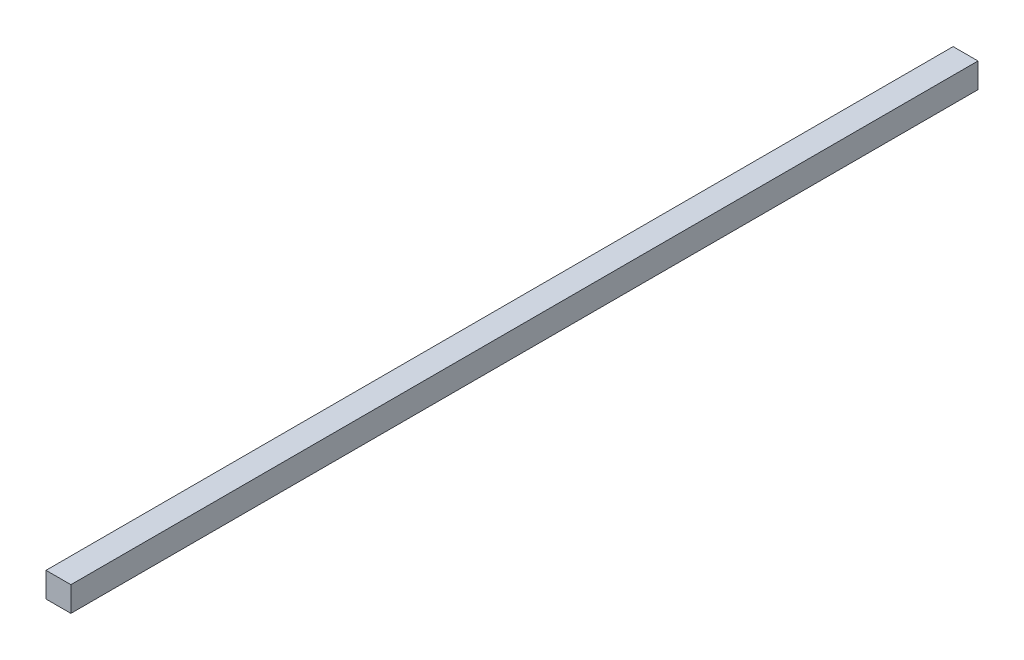
ISO-10303-21;
HEADER;
FILE_DESCRIPTION(('STEP AP214'),'2;1');
FILE_NAME('part.step','',(''),(''),'','','');
FILE_SCHEMA(('AUTOMOTIVE_DESIGN { 1 0 10303 214 1 1 1 1 }'));
ENDSEC;
DATA;
#1=APPLICATION_CONTEXT('core data for automotive mechanical design processes');
#2=APPLICATION_PROTOCOL_DEFINITION('international standard','automotive_design',2000,#1);
#3=PRODUCT_CONTEXT('',#1,'mechanical');
#4=PRODUCT('Part','Part','',(#3));
#5=PRODUCT_RELATED_PRODUCT_CATEGORY('part','',(#4));
#6=PRODUCT_DEFINITION_FORMATION('','',#4);
#7=PRODUCT_DEFINITION_CONTEXT('part definition',#1,'design');
#8=PRODUCT_DEFINITION('design','',#6,#7);
#9=PRODUCT_DEFINITION_SHAPE('','',#8);
#10=(LENGTH_UNIT() NAMED_UNIT(*) SI_UNIT(.MILLI.,.METRE.));
#11=(NAMED_UNIT(*) PLANE_ANGLE_UNIT() SI_UNIT($,.RADIAN.));
#12=(NAMED_UNIT(*) SI_UNIT($,.STERADIAN.) SOLID_ANGLE_UNIT());
#13=UNCERTAINTY_MEASURE_WITH_UNIT(LENGTH_MEASURE(1.E-05),#10,'distance_accuracy_value','');
#14=(GEOMETRIC_REPRESENTATION_CONTEXT(3) GLOBAL_UNCERTAINTY_ASSIGNED_CONTEXT((#13)) GLOBAL_UNIT_ASSIGNED_CONTEXT((#10,
#11,#12)) REPRESENTATION_CONTEXT('',''));
#15=CARTESIAN_POINT('',(0.,0.,0.));
#16=DIRECTION('',(0.,0.,1.));
#17=DIRECTION('',(1.,0.,0.));
#18=AXIS2_PLACEMENT_3D('',#15,#16,#17);
#19=CARTESIAN_POINT('',(10.,-10.,364.5));
#20=DIRECTION('',(-1.,0.,0.));
#21=DIRECTION('',(0.,0.,1.));
#22=AXIS2_PLACEMENT_3D('',#19,#20,#21);
#23=PLANE('',#22);
#24=DIRECTION('',(0.,1.,0.));
#25=VECTOR('',#24,1.);
#26=CARTESIAN_POINT('',(10.,-10.,-364.5));
#27=LINE('',#26,#25);
#28=CARTESIAN_POINT('',(10.,-10.,-364.5));
#29=VERTEX_POINT('',#28);
#30=CARTESIAN_POINT('',(10.,10.,-364.5));
#31=VERTEX_POINT('',#30);
#32=EDGE_CURVE('E98',#29,#31,#27,.T.);
#33=ORIENTED_EDGE('',*,*,#32,.T.);
#34=DIRECTION('',(0.,0.,-1.));
#35=VECTOR('',#34,1.);
#36=CARTESIAN_POINT('',(10.,10.,364.5));
#37=LINE('',#36,#35);
#38=CARTESIAN_POINT('',(10.,10.,364.5));
#39=VERTEX_POINT('',#38);
#40=EDGE_CURVE('E11',#39,#31,#37,.T.);
#41=ORIENTED_EDGE('',*,*,#40,.F.);
#42=DIRECTION('',(0.,1.,0.));
#43=VECTOR('',#42,1.);
#44=CARTESIAN_POINT('',(10.,-10.,364.5));
#45=LINE('',#44,#43);
#46=CARTESIAN_POINT('',(10.,-10.,364.5));
#47=VERTEX_POINT('',#46);
#48=EDGE_CURVE('E86',#47,#39,#45,.T.);
#49=ORIENTED_EDGE('',*,*,#48,.F.);
#50=DIRECTION('',(0.,0.,-1.));
#51=VECTOR('',#50,1.);
#52=CARTESIAN_POINT('',(10.,-10.,364.5));
#53=LINE('',#52,#51);
#54=EDGE_CURVE('E94',#47,#29,#53,.T.);
#55=ORIENTED_EDGE('',*,*,#54,.T.);
#56=EDGE_LOOP('',(#33,#41,#49,#55));
#57=FACE_BOUND('',#56,.T.);
#58=ADVANCED_FACE('F35',(#57),#23,.F.);
#59=CARTESIAN_POINT('',(-10.,10.,364.5));
#60=DIRECTION('',(0.,-1.,0.));
#61=DIRECTION('',(0.,0.,-1.));
#62=AXIS2_PLACEMENT_3D('',#59,#60,#61);
#63=PLANE('',#62);
#64=DIRECTION('',(-1.,0.,0.));
#65=VECTOR('',#64,1.);
#66=CARTESIAN_POINT('',(-10.,10.,-364.5));
#67=LINE('',#66,#65);
#68=CARTESIAN_POINT('',(-10.,10.,-364.5));
#69=VERTEX_POINT('',#68);
#70=EDGE_CURVE('E90',#31,#69,#67,.T.);
#71=ORIENTED_EDGE('',*,*,#70,.T.);
#72=DIRECTION('',(0.,0.,-1.));
#73=VECTOR('',#72,1.);
#74=CARTESIAN_POINT('',(-10.,10.,364.5));
#75=LINE('',#74,#73);
#76=CARTESIAN_POINT('',(-10.,10.,364.5));
#77=VERTEX_POINT('',#76);
#78=EDGE_CURVE('E43',#77,#69,#75,.T.);
#79=ORIENTED_EDGE('',*,*,#78,.F.);
#80=DIRECTION('',(-1.,0.,0.));
#81=VECTOR('',#80,1.);
#82=CARTESIAN_POINT('',(-10.,10.,364.5));
#83=LINE('',#82,#81);
#84=EDGE_CURVE('E81',#39,#77,#83,.T.);
#85=ORIENTED_EDGE('',*,*,#84,.F.);
#86=ORIENTED_EDGE('',*,*,#40,.T.);
#87=EDGE_LOOP('',(#71,#79,#85,#86));
#88=FACE_BOUND('',#87,.T.);
#89=ADVANCED_FACE('F89',(#88),#63,.F.);
#90=CARTESIAN_POINT('',(-10.,-10.,364.5));
#91=DIRECTION('',(1.,0.,0.));
#92=DIRECTION('',(0.,0.,-1.));
#93=AXIS2_PLACEMENT_3D('',#90,#91,#92);
#94=PLANE('',#93);
#95=DIRECTION('',(0.,-1.,0.));
#96=VECTOR('',#95,1.);
#97=CARTESIAN_POINT('',(-10.,-10.,-364.5));
#98=LINE('',#97,#96);
#99=CARTESIAN_POINT('',(-10.,-10.,-364.5));
#100=VERTEX_POINT('',#99);
#101=EDGE_CURVE('E68',#69,#100,#98,.T.);
#102=ORIENTED_EDGE('',*,*,#101,.T.);
#103=DIRECTION('',(0.,0.,-1.));
#104=VECTOR('',#103,1.);
#105=CARTESIAN_POINT('',(-10.,-10.,364.5));
#106=LINE('',#105,#104);
#107=CARTESIAN_POINT('',(-10.,-10.,364.5));
#108=VERTEX_POINT('',#107);
#109=EDGE_CURVE('E91',#108,#100,#106,.T.);
#110=ORIENTED_EDGE('',*,*,#109,.F.);
#111=DIRECTION('',(0.,-1.,0.));
#112=VECTOR('',#111,1.);
#113=CARTESIAN_POINT('',(-10.,-10.,364.5));
#114=LINE('',#113,#112);
#115=EDGE_CURVE('E84',#77,#108,#114,.T.);
#116=ORIENTED_EDGE('',*,*,#115,.F.);
#117=ORIENTED_EDGE('',*,*,#78,.T.);
#118=EDGE_LOOP('',(#102,#110,#116,#117));
#119=FACE_BOUND('',#118,.T.);
#120=ADVANCED_FACE('F92',(#119),#94,.F.);
#121=CARTESIAN_POINT('',(-10.,-10.,364.5));
#122=DIRECTION('',(0.,1.,0.));
#123=DIRECTION('',(0.,0.,1.));
#124=AXIS2_PLACEMENT_3D('',#121,#122,#123);
#125=PLANE('',#124);
#126=DIRECTION('',(1.,0.,0.));
#127=VECTOR('',#126,1.);
#128=CARTESIAN_POINT('',(-10.,-10.,-364.5));
#129=LINE('',#128,#127);
#130=EDGE_CURVE('E74',#100,#29,#129,.T.);
#131=ORIENTED_EDGE('',*,*,#130,.T.);
#132=ORIENTED_EDGE('',*,*,#54,.F.);
#133=DIRECTION('',(1.,0.,0.));
#134=VECTOR('',#133,1.);
#135=CARTESIAN_POINT('',(-10.,-10.,364.5));
#136=LINE('',#135,#134);
#137=EDGE_CURVE('E51',#108,#47,#136,.T.);
#138=ORIENTED_EDGE('',*,*,#137,.F.);
#139=ORIENTED_EDGE('',*,*,#109,.T.);
#140=EDGE_LOOP('',(#131,#132,#138,#139));
#141=FACE_BOUND('',#140,.T.);
#142=ADVANCED_FACE('F105',(#141),#125,.F.);
#143=CARTESIAN_POINT('',(0.,0.,364.5));
#144=DIRECTION('',(0.,0.,-1.));
#145=DIRECTION('',(-1.,0.,0.));
#146=AXIS2_PLACEMENT_3D('',#143,#144,#145);
#147=PLANE('',#146);
#148=ORIENTED_EDGE('',*,*,#48,.T.);
#149=ORIENTED_EDGE('',*,*,#84,.T.);
#150=ORIENTED_EDGE('',*,*,#115,.T.);
#151=ORIENTED_EDGE('',*,*,#137,.T.);
#152=EDGE_LOOP('',(#148,#149,#150,#151));
#153=FACE_BOUND('',#152,.T.);
#154=ADVANCED_FACE('F82',(#153),#147,.F.);
#155=CARTESIAN_POINT('',(0.,0.,-364.5));
#156=DIRECTION('',(0.,0.,-1.));
#157=DIRECTION('',(-1.,0.,0.));
#158=AXIS2_PLACEMENT_3D('',#155,#156,#157);
#159=PLANE('',#158);
#160=ORIENTED_EDGE('',*,*,#32,.F.);
#161=ORIENTED_EDGE('',*,*,#130,.F.);
#162=ORIENTED_EDGE('',*,*,#101,.F.);
#163=ORIENTED_EDGE('',*,*,#70,.F.);
#164=EDGE_LOOP('',(#160,#161,#162,#163));
#165=FACE_BOUND('',#164,.T.);
#166=ADVANCED_FACE('F108',(#165),#159,.T.);
#167=CLOSED_SHELL('',(#58,#89,#120,#142,#154,#166));
#168=MANIFOLD_SOLID_BREP('B2',#167);
#169=ADVANCED_BREP_SHAPE_REPRESENTATION('',(#18,#168),#14);
#170=SHAPE_DEFINITION_REPRESENTATION(#9,#169);
ENDSEC;
END-ISO-10303-21;
